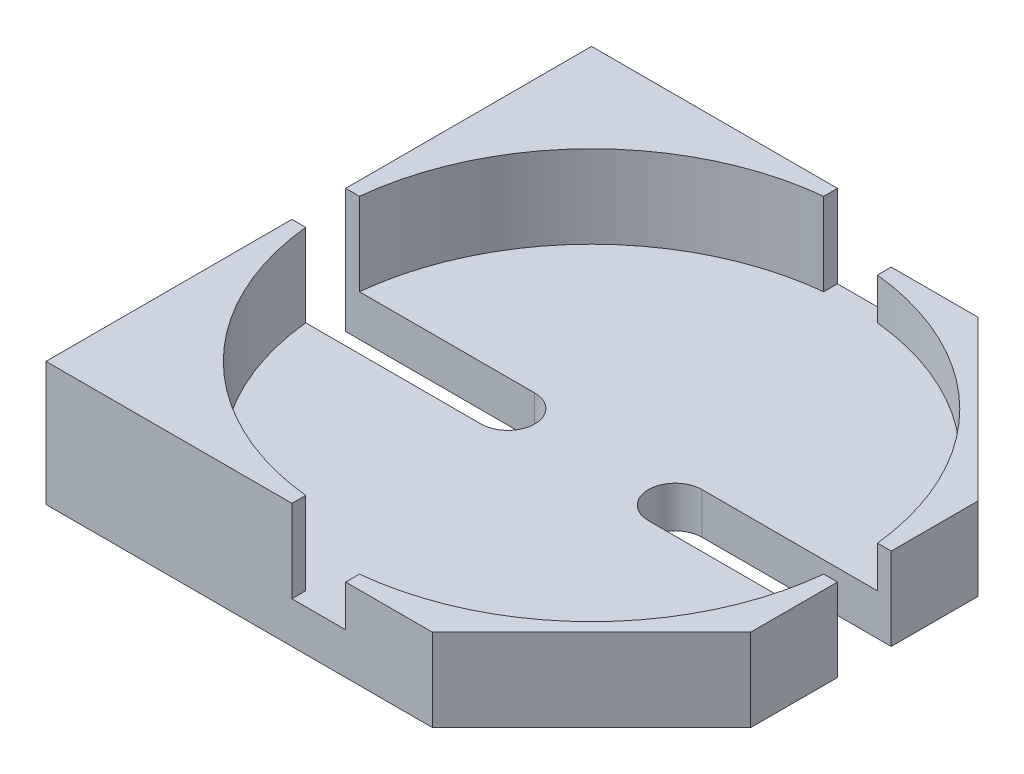
ISO-10303-21;
HEADER;
FILE_DESCRIPTION(('STEP AP214'),'2;1');
FILE_NAME('part.step','',(''),(''),'','','');
FILE_SCHEMA(('AUTOMOTIVE_DESIGN { 1 0 10303 214 1 1 1 1 }'));
ENDSEC;
DATA;
#1=APPLICATION_CONTEXT('core data for automotive mechanical design processes');
#2=APPLICATION_PROTOCOL_DEFINITION('international standard','automotive_design',2000,#1);
#3=PRODUCT_CONTEXT('',#1,'mechanical');
#4=PRODUCT('Part','Part','',(#3));
#5=PRODUCT_RELATED_PRODUCT_CATEGORY('part','',(#4));
#6=PRODUCT_DEFINITION_FORMATION('','',#4);
#7=PRODUCT_DEFINITION_CONTEXT('part definition',#1,'design');
#8=PRODUCT_DEFINITION('design','',#6,#7);
#9=PRODUCT_DEFINITION_SHAPE('','',#8);
#10=(LENGTH_UNIT() NAMED_UNIT(*) SI_UNIT(.MILLI.,.METRE.));
#11=(NAMED_UNIT(*) PLANE_ANGLE_UNIT() SI_UNIT($,.RADIAN.));
#12=(NAMED_UNIT(*) SI_UNIT($,.STERADIAN.) SOLID_ANGLE_UNIT());
#13=UNCERTAINTY_MEASURE_WITH_UNIT(LENGTH_MEASURE(1.E-05),#10,'distance_accuracy_value','');
#14=(GEOMETRIC_REPRESENTATION_CONTEXT(3) GLOBAL_UNCERTAINTY_ASSIGNED_CONTEXT((#13)) GLOBAL_UNIT_ASSIGNED_CONTEXT((#10,
#11,#12)) REPRESENTATION_CONTEXT('',''));
#15=CARTESIAN_POINT('',(0.,0.,0.));
#16=DIRECTION('',(0.,0.,1.));
#17=DIRECTION('',(1.,0.,0.));
#18=AXIS2_PLACEMENT_3D('',#15,#16,#17);
#19=CARTESIAN_POINT('',(0.,1.,0.));
#20=DIRECTION('',(0.,1.,0.));
#21=DIRECTION('',(1.,0.,0.));
#22=AXIS2_PLACEMENT_3D('',#19,#20,#21);
#23=PLANE('',#22);
#24=CARTESIAN_POINT('',(0.,1.,0.));
#25=DIRECTION('',(0.,1.,0.));
#26=DIRECTION('',(0.,0.,1.));
#27=AXIS2_PLACEMENT_3D('',#24,#25,#26);
#28=CIRCLE('',#27,3.15);
#29=CARTESIAN_POINT('',(0.325000000000011,1.,3.13318926973778));
#30=VERTEX_POINT('',#29);
#31=CARTESIAN_POINT('',(3.13318926973778,1.,0.325));
#32=VERTEX_POINT('',#31);
#33=EDGE_CURVE('E26',#30,#32,#28,.T.);
#34=ORIENTED_EDGE('',*,*,#33,.F.);
#35=DIRECTION('',(0.,0.,-1.));
#36=VECTOR('',#35,1.);
#37=CARTESIAN_POINT('',(0.325000000000011,1.,0.));
#38=LINE('',#37,#36);
#39=CARTESIAN_POINT('',(0.325000000000011,1.,3.3));
#40=VERTEX_POINT('',#39);
#41=EDGE_CURVE('E11',#40,#30,#38,.T.);
#42=ORIENTED_EDGE('',*,*,#41,.F.);
#43=DIRECTION('',(1.,0.,0.));
#44=VECTOR('',#43,1.);
#45=CARTESIAN_POINT('',(0.,1.,3.3));
#46=LINE('',#45,#44);
#47=CARTESIAN_POINT('',(1.37500000000002,1.,3.3));
#48=VERTEX_POINT('',#47);
#49=EDGE_CURVE('E383',#40,#48,#46,.T.);
#50=ORIENTED_EDGE('',*,*,#49,.T.);
#51=DIRECTION('',(0.707106781186544,0.,-0.707106781186552));
#52=VECTOR('',#51,1.);
#53=CARTESIAN_POINT('',(2.3375,1.,2.3375));
#54=LINE('',#53,#52);
#55=CARTESIAN_POINT('',(3.3,1.,1.375));
#56=VERTEX_POINT('',#55);
#57=EDGE_CURVE('E370',#48,#56,#54,.T.);
#58=ORIENTED_EDGE('',*,*,#57,.T.);
#59=DIRECTION('',(0.,0.,-1.));
#60=VECTOR('',#59,1.);
#61=CARTESIAN_POINT('',(3.3,1.,0.));
#62=LINE('',#61,#60);
#63=CARTESIAN_POINT('',(3.3,1.,0.325));
#64=VERTEX_POINT('',#63);
#65=EDGE_CURVE('E431',#56,#64,#62,.T.);
#66=ORIENTED_EDGE('',*,*,#65,.T.);
#67=DIRECTION('',(-1.,0.,0.));
#68=VECTOR('',#67,1.);
#69=CARTESIAN_POINT('',(0.,1.,0.325));
#70=LINE('',#69,#68);
#71=EDGE_CURVE('E259',#64,#32,#70,.T.);
#72=ORIENTED_EDGE('',*,*,#71,.T.);
#73=EDGE_LOOP('',(#34,#42,#50,#58,#66,#72));
#74=FACE_BOUND('',#73,.T.);
#75=ADVANCED_FACE('F17',(#74),#23,.T.);
#76=CARTESIAN_POINT('',(0.325000000000011,1.,0.));
#77=DIRECTION('',(-1.,0.,0.));
#78=DIRECTION('',(0.,0.,1.));
#79=AXIS2_PLACEMENT_3D('',#76,#77,#78);
#80=PLANE('',#79);
#81=DIRECTION('',(0.,0.,-1.));
#82=VECTOR('',#81,1.);
#83=CARTESIAN_POINT('',(0.325000000000011,0.5,0.));
#84=LINE('',#83,#82);
#85=CARTESIAN_POINT('',(0.325000000000011,0.5,3.3));
#86=VERTEX_POINT('',#85);
#87=CARTESIAN_POINT('',(0.325000000000011,0.5,3.13318926973778));
#88=VERTEX_POINT('',#87);
#89=EDGE_CURVE('E277',#86,#88,#84,.T.);
#90=ORIENTED_EDGE('',*,*,#89,.F.);
#91=DIRECTION('',(0.,-1.,0.));
#92=VECTOR('',#91,1.);
#93=CARTESIAN_POINT('',(0.325000000000011,1.,3.3));
#94=LINE('',#93,#92);
#95=EDGE_CURVE('E387',#40,#86,#94,.T.);
#96=ORIENTED_EDGE('',*,*,#95,.F.);
#97=ORIENTED_EDGE('',*,*,#41,.T.);
#98=DIRECTION('',(0.,-1.,0.));
#99=VECTOR('',#98,1.);
#100=CARTESIAN_POINT('',(0.325000000000011,1.,3.13318926973778));
#101=LINE('',#100,#99);
#102=EDGE_CURVE('E542',#30,#88,#101,.T.);
#103=ORIENTED_EDGE('',*,*,#102,.T.);
#104=EDGE_LOOP('',(#90,#96,#97,#103));
#105=FACE_BOUND('',#104,.T.);
#106=ADVANCED_FACE('F19',(#105),#80,.T.);
#107=CARTESIAN_POINT('',(0.,1.,0.));
#108=DIRECTION('',(0.,-1.,0.));
#109=DIRECTION('',(0.,0.,-1.));
#110=AXIS2_PLACEMENT_3D('',#107,#108,#109);
#111=CYLINDRICAL_SURFACE('',#110,3.15);
#112=CARTESIAN_POINT('',(0.,0.5,0.));
#113=DIRECTION('',(0.,1.,0.));
#114=DIRECTION('',(0.,0.,1.));
#115=AXIS2_PLACEMENT_3D('',#112,#113,#114);
#116=CIRCLE('',#115,3.15);
#117=CARTESIAN_POINT('',(3.13318926973778,0.5,0.325));
#118=VERTEX_POINT('',#117);
#119=EDGE_CURVE('E255',#88,#118,#116,.T.);
#120=ORIENTED_EDGE('',*,*,#119,.F.);
#121=ORIENTED_EDGE('',*,*,#102,.F.);
#122=ORIENTED_EDGE('',*,*,#33,.T.);
#123=DIRECTION('',(0.,-1.,0.));
#124=VECTOR('',#123,1.);
#125=CARTESIAN_POINT('',(3.13318926973778,1.,0.325));
#126=LINE('',#125,#124);
#127=EDGE_CURVE('E250',#32,#118,#126,.T.);
#128=ORIENTED_EDGE('',*,*,#127,.T.);
#129=EDGE_LOOP('',(#120,#121,#122,#128));
#130=FACE_BOUND('',#129,.T.);
#131=ADVANCED_FACE('F252',(#130),#111,.F.);
#132=CARTESIAN_POINT('',(0.,1.,0.));
#133=DIRECTION('',(0.,1.,0.));
#134=DIRECTION('',(1.,0.,0.));
#135=AXIS2_PLACEMENT_3D('',#132,#133,#134);
#136=PLANE('',#135);
#137=CARTESIAN_POINT('',(0.,1.,0.));
#138=DIRECTION('',(0.,1.,0.));
#139=DIRECTION('',(0.,0.,1.));
#140=AXIS2_PLACEMENT_3D('',#137,#138,#139);
#141=CIRCLE('',#140,3.15);
#142=CARTESIAN_POINT('',(3.13318926973778,1.,-0.325));
#143=VERTEX_POINT('',#142);
#144=CARTESIAN_POINT('',(0.325000000000005,1.,-3.13318926973778));
#145=VERTEX_POINT('',#144);
#146=EDGE_CURVE('E347',#143,#145,#141,.T.);
#147=ORIENTED_EDGE('',*,*,#146,.F.);
#148=DIRECTION('',(1.,0.,0.));
#149=VECTOR('',#148,1.);
#150=CARTESIAN_POINT('',(0.,1.,-0.325));
#151=LINE('',#150,#149);
#152=CARTESIAN_POINT('',(3.3,1.,-0.325));
#153=VERTEX_POINT('',#152);
#154=EDGE_CURVE('E444',#143,#153,#151,.T.);
#155=ORIENTED_EDGE('',*,*,#154,.T.);
#156=DIRECTION('',(0.,0.,-1.));
#157=VECTOR('',#156,1.);
#158=CARTESIAN_POINT('',(3.3,1.,0.));
#159=LINE('',#158,#157);
#160=CARTESIAN_POINT('',(3.3,1.,-1.375));
#161=VERTEX_POINT('',#160);
#162=EDGE_CURVE('E477',#153,#161,#159,.T.);
#163=ORIENTED_EDGE('',*,*,#162,.T.);
#164=DIRECTION('',(-0.707106781186549,0.,-0.707106781186546));
#165=VECTOR('',#164,1.);
#166=CARTESIAN_POINT('',(2.3375,1.,-2.3375));
#167=LINE('',#166,#165);
#168=CARTESIAN_POINT('',(1.375,1.,-3.3));
#169=VERTEX_POINT('',#168);
#170=EDGE_CURVE('E395',#161,#169,#167,.T.);
#171=ORIENTED_EDGE('',*,*,#170,.T.);
#172=DIRECTION('',(-1.,0.,0.));
#173=VECTOR('',#172,1.);
#174=CARTESIAN_POINT('',(0.,1.,-3.3));
#175=LINE('',#174,#173);
#176=CARTESIAN_POINT('',(0.325000000000005,1.,-3.3));
#177=VERTEX_POINT('',#176);
#178=EDGE_CURVE('E402',#169,#177,#175,.T.);
#179=ORIENTED_EDGE('',*,*,#178,.T.);
#180=DIRECTION('',(0.,0.,1.));
#181=VECTOR('',#180,1.);
#182=CARTESIAN_POINT('',(0.325000000000005,1.,0.));
#183=LINE('',#182,#181);
#184=EDGE_CURVE('E48',#177,#145,#183,.T.);
#185=ORIENTED_EDGE('',*,*,#184,.T.);
#186=EDGE_LOOP('',(#147,#155,#163,#171,#179,#185));
#187=FACE_BOUND('',#186,.T.);
#188=ADVANCED_FACE('F1158',(#187),#136,.T.);
#189=CARTESIAN_POINT('',(0.325000000000005,1.,0.));
#190=DIRECTION('',(1.,0.,0.));
#191=DIRECTION('',(0.,1.,0.));
#192=AXIS2_PLACEMENT_3D('',#189,#190,#191);
#193=PLANE('',#192);
#194=DIRECTION('',(0.,0.,1.));
#195=VECTOR('',#194,1.);
#196=CARTESIAN_POINT('',(0.325000000000005,0.5,0.));
#197=LINE('',#196,#195);
#198=CARTESIAN_POINT('',(0.325000000000005,0.5,-3.3));
#199=VERTEX_POINT('',#198);
#200=CARTESIAN_POINT('',(0.325000000000005,0.5,-3.13318926973778));
#201=VERTEX_POINT('',#200);
#202=EDGE_CURVE('E315',#199,#201,#197,.T.);
#203=ORIENTED_EDGE('',*,*,#202,.T.);
#204=DIRECTION('',(0.,-1.,0.));
#205=VECTOR('',#204,1.);
#206=CARTESIAN_POINT('',(0.325000000000005,1.,-3.13318926973778));
#207=LINE('',#206,#205);
#208=EDGE_CURVE('E351',#145,#201,#207,.T.);
#209=ORIENTED_EDGE('',*,*,#208,.F.);
#210=ORIENTED_EDGE('',*,*,#184,.F.);
#211=DIRECTION('',(0.,-1.,0.));
#212=VECTOR('',#211,1.);
#213=CARTESIAN_POINT('',(0.325000000000005,1.,-3.3));
#214=LINE('',#213,#212);
#215=EDGE_CURVE('E399',#177,#199,#214,.T.);
#216=ORIENTED_EDGE('',*,*,#215,.T.);
#217=EDGE_LOOP('',(#203,#209,#210,#216));
#218=FACE_BOUND('',#217,.T.);
#219=ADVANCED_FACE('F1149',(#218),#193,.F.);
#220=CARTESIAN_POINT('',(0.,1.,0.));
#221=DIRECTION('',(0.,-1.,0.));
#222=DIRECTION('',(0.,0.,-1.));
#223=AXIS2_PLACEMENT_3D('',#220,#221,#222);
#224=CYLINDRICAL_SURFACE('',#223,3.15);
#225=CARTESIAN_POINT('',(0.,0.5,0.));
#226=DIRECTION('',(0.,1.,0.));
#227=DIRECTION('',(0.,0.,1.));
#228=AXIS2_PLACEMENT_3D('',#225,#226,#227);
#229=CIRCLE('',#228,3.15);
#230=CARTESIAN_POINT('',(3.13318926973778,0.5,-0.325));
#231=VERTEX_POINT('',#230);
#232=EDGE_CURVE('E292',#231,#201,#229,.T.);
#233=ORIENTED_EDGE('',*,*,#232,.F.);
#234=DIRECTION('',(0.,-1.,0.));
#235=VECTOR('',#234,1.);
#236=CARTESIAN_POINT('',(3.13318926973778,1.,-0.325));
#237=LINE('',#236,#235);
#238=EDGE_CURVE('E437',#143,#231,#237,.T.);
#239=ORIENTED_EDGE('',*,*,#238,.F.);
#240=ORIENTED_EDGE('',*,*,#146,.T.);
#241=ORIENTED_EDGE('',*,*,#208,.T.);
#242=EDGE_LOOP('',(#233,#239,#240,#241));
#243=FACE_BOUND('',#242,.T.);
#244=ADVANCED_FACE('F1132',(#243),#224,.F.);
#245=CARTESIAN_POINT('',(0.,1.5,0.));
#246=DIRECTION('',(0.,1.,0.));
#247=DIRECTION('',(1.,0.,0.));
#248=AXIS2_PLACEMENT_3D('',#245,#246,#247);
#249=PLANE('',#248);
#250=CARTESIAN_POINT('',(0.,1.5,0.));
#251=DIRECTION('',(0.,1.,0.));
#252=DIRECTION('',(0.,0.,1.));
#253=AXIS2_PLACEMENT_3D('',#250,#251,#252);
#254=CIRCLE('',#253,3.15);
#255=CARTESIAN_POINT('',(-3.13318926973778,1.5,0.325));
#256=VERTEX_POINT('',#255);
#257=CARTESIAN_POINT('',(-0.325,1.5,3.13318926973778));
#258=VERTEX_POINT('',#257);
#259=EDGE_CURVE('E532',#256,#258,#254,.T.);
#260=ORIENTED_EDGE('',*,*,#259,.F.);
#261=DIRECTION('',(-1.,0.,0.));
#262=VECTOR('',#261,1.);
#263=CARTESIAN_POINT('',(0.,1.5,0.325));
#264=LINE('',#263,#262);
#265=CARTESIAN_POINT('',(-3.3,1.5,0.325));
#266=VERTEX_POINT('',#265);
#267=EDGE_CURVE('E468',#256,#266,#264,.T.);
#268=ORIENTED_EDGE('',*,*,#267,.T.);
#269=DIRECTION('',(0.,0.,1.));
#270=VECTOR('',#269,1.);
#271=CARTESIAN_POINT('',(-3.3,1.5,0.));
#272=LINE('',#271,#270);
#273=CARTESIAN_POINT('',(-3.3,1.5,3.3));
#274=VERTEX_POINT('',#273);
#275=EDGE_CURVE('E356',#266,#274,#272,.T.);
#276=ORIENTED_EDGE('',*,*,#275,.T.);
#277=DIRECTION('',(1.,0.,0.));
#278=VECTOR('',#277,1.);
#279=CARTESIAN_POINT('',(0.,1.5,3.3));
#280=LINE('',#279,#278);
#281=CARTESIAN_POINT('',(-0.325,1.5,3.3));
#282=VERTEX_POINT('',#281);
#283=EDGE_CURVE('E398',#274,#282,#280,.T.);
#284=ORIENTED_EDGE('',*,*,#283,.T.);
#285=DIRECTION('',(0.,0.,-1.));
#286=VECTOR('',#285,1.);
#287=CARTESIAN_POINT('',(-0.325,1.5,0.));
#288=LINE('',#287,#286);
#289=EDGE_CURVE('E352',#282,#258,#288,.T.);
#290=ORIENTED_EDGE('',*,*,#289,.T.);
#291=EDGE_LOOP('',(#260,#268,#276,#284,#290));
#292=FACE_BOUND('',#291,.T.);
#293=ADVANCED_FACE('F1123',(#292),#249,.T.);
#294=CARTESIAN_POINT('',(-0.325,1.5,0.));
#295=DIRECTION('',(-1.,0.,0.));
#296=DIRECTION('',(0.,0.,1.));
#297=AXIS2_PLACEMENT_3D('',#294,#295,#296);
#298=PLANE('',#297);
#299=DIRECTION('',(0.,0.,-1.));
#300=VECTOR('',#299,1.);
#301=CARTESIAN_POINT('',(-0.325,0.5,0.));
#302=LINE('',#301,#300);
#303=CARTESIAN_POINT('',(-0.325,0.5,3.3));
#304=VERTEX_POINT('',#303);
#305=CARTESIAN_POINT('',(-0.325,0.5,3.13318926973778));
#306=VERTEX_POINT('',#305);
#307=EDGE_CURVE('E303',#304,#306,#302,.T.);
#308=ORIENTED_EDGE('',*,*,#307,.T.);
#309=DIRECTION('',(0.,-1.,0.));
#310=VECTOR('',#309,1.);
#311=CARTESIAN_POINT('',(-0.325,1.5,3.13318926973778));
#312=LINE('',#311,#310);
#313=EDGE_CURVE('E501',#258,#306,#312,.T.);
#314=ORIENTED_EDGE('',*,*,#313,.F.);
#315=ORIENTED_EDGE('',*,*,#289,.F.);
#316=DIRECTION('',(0.,-1.,0.));
#317=VECTOR('',#316,1.);
#318=CARTESIAN_POINT('',(-0.325,1.5,3.3));
#319=LINE('',#318,#317);
#320=EDGE_CURVE('E390',#282,#304,#319,.T.);
#321=ORIENTED_EDGE('',*,*,#320,.T.);
#322=EDGE_LOOP('',(#308,#314,#315,#321));
#323=FACE_BOUND('',#322,.T.);
#324=ADVANCED_FACE('F1114',(#323),#298,.F.);
#325=CARTESIAN_POINT('',(0.,1.5,0.));
#326=DIRECTION('',(0.,-1.,0.));
#327=DIRECTION('',(0.,0.,-1.));
#328=AXIS2_PLACEMENT_3D('',#325,#326,#327);
#329=CYLINDRICAL_SURFACE('',#328,3.15);
#330=CARTESIAN_POINT('',(0.,0.5,0.));
#331=DIRECTION('',(0.,1.,0.));
#332=DIRECTION('',(0.,0.,1.));
#333=AXIS2_PLACEMENT_3D('',#330,#331,#332);
#334=CIRCLE('',#333,3.15);
#335=CARTESIAN_POINT('',(-3.13318926973778,0.5,0.325));
#336=VERTEX_POINT('',#335);
#337=EDGE_CURVE('E299',#336,#306,#334,.T.);
#338=ORIENTED_EDGE('',*,*,#337,.F.);
#339=DIRECTION('',(0.,-1.,0.));
#340=VECTOR('',#339,1.);
#341=CARTESIAN_POINT('',(-3.13318926973778,1.5,0.325));
#342=LINE('',#341,#340);
#343=EDGE_CURVE('E311',#256,#336,#342,.T.);
#344=ORIENTED_EDGE('',*,*,#343,.F.);
#345=ORIENTED_EDGE('',*,*,#259,.T.);
#346=ORIENTED_EDGE('',*,*,#313,.T.);
#347=EDGE_LOOP('',(#338,#344,#345,#346));
#348=FACE_BOUND('',#347,.T.);
#349=ADVANCED_FACE('F1105',(#348),#329,.F.);
#350=CARTESIAN_POINT('',(0.,1.5,0.));
#351=DIRECTION('',(0.,1.,0.));
#352=DIRECTION('',(1.,0.,0.));
#353=AXIS2_PLACEMENT_3D('',#350,#351,#352);
#354=PLANE('',#353);
#355=CARTESIAN_POINT('',(0.,1.5,0.));
#356=DIRECTION('',(0.,1.,0.));
#357=DIRECTION('',(0.,0.,1.));
#358=AXIS2_PLACEMENT_3D('',#355,#356,#357);
#359=CIRCLE('',#358,3.15);
#360=CARTESIAN_POINT('',(-0.325000000000007,1.5,-3.13318926973778));
#361=VERTEX_POINT('',#360);
#362=CARTESIAN_POINT('',(-3.13318926973778,1.5,-0.325));
#363=VERTEX_POINT('',#362);
#364=EDGE_CURVE('E310',#361,#363,#359,.T.);
#365=ORIENTED_EDGE('',*,*,#364,.F.);
#366=DIRECTION('',(0.,0.,1.));
#367=VECTOR('',#366,1.);
#368=CARTESIAN_POINT('',(-0.325000000000009,1.5,0.));
#369=LINE('',#368,#367);
#370=CARTESIAN_POINT('',(-0.325000000000007,1.5,-3.3));
#371=VERTEX_POINT('',#370);
#372=EDGE_CURVE('E529',#371,#361,#369,.T.);
#373=ORIENTED_EDGE('',*,*,#372,.F.);
#374=DIRECTION('',(-1.,0.,0.));
#375=VECTOR('',#374,1.);
#376=CARTESIAN_POINT('',(0.,1.5,-3.3));
#377=LINE('',#376,#375);
#378=CARTESIAN_POINT('',(-3.3,1.5,-3.3));
#379=VERTEX_POINT('',#378);
#380=EDGE_CURVE('E495',#371,#379,#377,.T.);
#381=ORIENTED_EDGE('',*,*,#380,.T.);
#382=DIRECTION('',(0.,0.,1.));
#383=VECTOR('',#382,1.);
#384=CARTESIAN_POINT('',(-3.3,1.5,0.));
#385=LINE('',#384,#383);
#386=CARTESIAN_POINT('',(-3.3,1.5,-0.325));
#387=VERTEX_POINT('',#386);
#388=EDGE_CURVE('E426',#379,#387,#385,.T.);
#389=ORIENTED_EDGE('',*,*,#388,.T.);
#390=DIRECTION('',(1.,0.,0.));
#391=VECTOR('',#390,1.);
#392=CARTESIAN_POINT('',(0.,1.5,-0.325));
#393=LINE('',#392,#391);
#394=EDGE_CURVE('E360',#387,#363,#393,.T.);
#395=ORIENTED_EDGE('',*,*,#394,.T.);
#396=EDGE_LOOP('',(#365,#373,#381,#389,#395));
#397=FACE_BOUND('',#396,.T.);
#398=ADVANCED_FACE('F1096',(#397),#354,.T.);
#399=CARTESIAN_POINT('',(-0.325000000000009,1.5,0.));
#400=DIRECTION('',(1.,0.,0.));
#401=DIRECTION('',(0.,0.,1.));
#402=AXIS2_PLACEMENT_3D('',#399,#400,#401);
#403=PLANE('',#402);
#404=DIRECTION('',(0.,0.,1.));
#405=VECTOR('',#404,1.);
#406=CARTESIAN_POINT('',(-0.325000000000009,0.5,0.));
#407=LINE('',#406,#405);
#408=CARTESIAN_POINT('',(-0.325000000000007,0.5,-3.3));
#409=VERTEX_POINT('',#408);
#410=CARTESIAN_POINT('',(-0.325000000000007,0.5,-3.13318926973778));
#411=VERTEX_POINT('',#410);
#412=EDGE_CURVE('E327',#409,#411,#407,.T.);
#413=ORIENTED_EDGE('',*,*,#412,.F.);
#414=DIRECTION('',(0.,-1.,0.));
#415=VECTOR('',#414,1.);
#416=CARTESIAN_POINT('',(-0.325000000000007,1.5,-3.3));
#417=LINE('',#416,#415);
#418=EDGE_CURVE('E403',#371,#409,#417,.T.);
#419=ORIENTED_EDGE('',*,*,#418,.F.);
#420=ORIENTED_EDGE('',*,*,#372,.T.);
#421=DIRECTION('',(0.,-1.,0.));
#422=VECTOR('',#421,1.);
#423=CARTESIAN_POINT('',(-0.325000000000007,1.5,-3.13318926973778));
#424=LINE('',#423,#422);
#425=EDGE_CURVE('E307',#361,#411,#424,.T.);
#426=ORIENTED_EDGE('',*,*,#425,.T.);
#427=EDGE_LOOP('',(#413,#419,#420,#426));
#428=FACE_BOUND('',#427,.T.);
#429=ADVANCED_FACE('F1087',(#428),#403,.T.);
#430=CARTESIAN_POINT('',(0.,1.5,0.));
#431=DIRECTION('',(0.,-1.,0.));
#432=DIRECTION('',(0.,0.,-1.));
#433=AXIS2_PLACEMENT_3D('',#430,#431,#432);
#434=CYLINDRICAL_SURFACE('',#433,3.15);
#435=CARTESIAN_POINT('',(0.,0.5,0.));
#436=DIRECTION('',(0.,1.,0.));
#437=DIRECTION('',(0.,0.,1.));
#438=AXIS2_PLACEMENT_3D('',#435,#436,#437);
#439=CIRCLE('',#438,3.15);
#440=CARTESIAN_POINT('',(-3.13318926973778,0.5,-0.325));
#441=VERTEX_POINT('',#440);
#442=EDGE_CURVE('E334',#411,#441,#439,.T.);
#443=ORIENTED_EDGE('',*,*,#442,.F.);
#444=ORIENTED_EDGE('',*,*,#425,.F.);
#445=ORIENTED_EDGE('',*,*,#364,.T.);
#446=DIRECTION('',(0.,-1.,0.));
#447=VECTOR('',#446,1.);
#448=CARTESIAN_POINT('',(-3.13318926973778,1.5,-0.325));
#449=LINE('',#448,#447);
#450=EDGE_CURVE('E357',#363,#441,#449,.T.);
#451=ORIENTED_EDGE('',*,*,#450,.T.);
#452=EDGE_LOOP('',(#443,#444,#445,#451));
#453=FACE_BOUND('',#452,.T.);
#454=ADVANCED_FACE('F1078',(#453),#434,.F.);
#455=CARTESIAN_POINT('',(1.0125,0.,0.));
#456=DIRECTION('',(0.,1.,0.));
#457=DIRECTION('',(1.,0.,0.));
#458=AXIS2_PLACEMENT_3D('',#455,#456,#457);
#459=PLANE('',#458);
#460=DIRECTION('',(0.,0.,1.));
#461=VECTOR('',#460,1.);
#462=CARTESIAN_POINT('',(-3.3,0.,0.325));
#463=LINE('',#462,#461);
#464=CARTESIAN_POINT('',(-3.3,0.,0.325));
#465=VERTEX_POINT('',#464);
#466=CARTESIAN_POINT('',(-3.3,0.,3.3));
#467=VERTEX_POINT('',#466);
#468=EDGE_CURVE('E318',#465,#467,#463,.T.);
#469=ORIENTED_EDGE('',*,*,#468,.F.);
#470=DIRECTION('',(-1.,0.,0.));
#471=VECTOR('',#470,1.);
#472=CARTESIAN_POINT('',(-1.0125,0.,0.325));
#473=LINE('',#472,#471);
#474=CARTESIAN_POINT('',(-1.0125,0.,0.325));
#475=VERTEX_POINT('',#474);
#476=EDGE_CURVE('E471',#475,#465,#473,.T.);
#477=ORIENTED_EDGE('',*,*,#476,.F.);
#478=CARTESIAN_POINT('',(-1.0125,0.,0.));
#479=DIRECTION('',(0.,-1.,0.));
#480=DIRECTION('',(0.,0.,1.));
#481=AXIS2_PLACEMENT_3D('',#478,#479,#480);
#482=CIRCLE('',#481,0.325);
#483=CARTESIAN_POINT('',(-1.0125,0.,-0.325));
#484=VERTEX_POINT('',#483);
#485=EDGE_CURVE('E515',#484,#475,#482,.T.);
#486=ORIENTED_EDGE('',*,*,#485,.F.);
#487=DIRECTION('',(1.,0.,0.));
#488=VECTOR('',#487,1.);
#489=CARTESIAN_POINT('',(-1.0125,0.,-0.325));
#490=LINE('',#489,#488);
#491=CARTESIAN_POINT('',(-3.3,0.,-0.325));
#492=VERTEX_POINT('',#491);
#493=EDGE_CURVE('E481',#492,#484,#490,.T.);
#494=ORIENTED_EDGE('',*,*,#493,.F.);
#495=DIRECTION('',(0.,0.,1.));
#496=VECTOR('',#495,1.);
#497=CARTESIAN_POINT('',(-3.3,0.,-3.3));
#498=LINE('',#497,#496);
#499=CARTESIAN_POINT('',(-3.3,0.,-3.3));
#500=VERTEX_POINT('',#499);
#501=EDGE_CURVE('E427',#500,#492,#498,.T.);
#502=ORIENTED_EDGE('',*,*,#501,.F.);
#503=DIRECTION('',(-1.,0.,0.));
#504=VECTOR('',#503,1.);
#505=CARTESIAN_POINT('',(1.375,0.,-3.3));
#506=LINE('',#505,#504);
#507=CARTESIAN_POINT('',(1.375,0.,-3.3));
#508=VERTEX_POINT('',#507);
#509=EDGE_CURVE('E410',#508,#500,#506,.T.);
#510=ORIENTED_EDGE('',*,*,#509,.F.);
#511=DIRECTION('',(-0.707106781186549,0.,-0.707106781186546));
#512=VECTOR('',#511,1.);
#513=CARTESIAN_POINT('',(1.375,0.,-3.3));
#514=LINE('',#513,#512);
#515=CARTESIAN_POINT('',(3.3,0.,-1.375));
#516=VERTEX_POINT('',#515);
#517=EDGE_CURVE('E284',#516,#508,#514,.T.);
#518=ORIENTED_EDGE('',*,*,#517,.F.);
#519=DIRECTION('',(0.,0.,-1.));
#520=VECTOR('',#519,1.);
#521=CARTESIAN_POINT('',(3.3,0.,-1.375));
#522=LINE('',#521,#520);
#523=CARTESIAN_POINT('',(3.3,0.,-0.325));
#524=VERTEX_POINT('',#523);
#525=EDGE_CURVE('E432',#524,#516,#522,.T.);
#526=ORIENTED_EDGE('',*,*,#525,.F.);
#527=DIRECTION('',(1.,0.,0.));
#528=VECTOR('',#527,1.);
#529=CARTESIAN_POINT('',(1.0125,0.,-0.325));
#530=LINE('',#529,#528);
#531=CARTESIAN_POINT('',(1.0125,0.,-0.325));
#532=VERTEX_POINT('',#531);
#533=EDGE_CURVE('E461',#532,#524,#530,.T.);
#534=ORIENTED_EDGE('',*,*,#533,.F.);
#535=CARTESIAN_POINT('',(1.0125,0.,0.));
#536=DIRECTION('',(0.,-1.,0.));
#537=DIRECTION('',(0.,0.,1.));
#538=AXIS2_PLACEMENT_3D('',#535,#536,#537);
#539=CIRCLE('',#538,0.325);
#540=CARTESIAN_POINT('',(1.0125,0.,0.325));
#541=VERTEX_POINT('',#540);
#542=EDGE_CURVE('E453',#541,#532,#539,.T.);
#543=ORIENTED_EDGE('',*,*,#542,.F.);
#544=DIRECTION('',(-1.,0.,0.));
#545=VECTOR('',#544,1.);
#546=CARTESIAN_POINT('',(1.0125,0.,0.325));
#547=LINE('',#546,#545);
#548=CARTESIAN_POINT('',(3.3,0.,0.325));
#549=VERTEX_POINT('',#548);
#550=EDGE_CURVE('E441',#549,#541,#547,.T.);
#551=ORIENTED_EDGE('',*,*,#550,.F.);
#552=DIRECTION('',(0.,0.,-1.));
#553=VECTOR('',#552,1.);
#554=CARTESIAN_POINT('',(3.3,0.,0.325));
#555=LINE('',#554,#553);
#556=CARTESIAN_POINT('',(3.3,0.,1.375));
#557=VERTEX_POINT('',#556);
#558=EDGE_CURVE('E417',#557,#549,#555,.T.);
#559=ORIENTED_EDGE('',*,*,#558,.F.);
#560=DIRECTION('',(0.707106781186544,0.,-0.707106781186552));
#561=VECTOR('',#560,1.);
#562=CARTESIAN_POINT('',(1.37500000000002,0.,3.3));
#563=LINE('',#562,#561);
#564=CARTESIAN_POINT('',(1.37500000000002,0.,3.3));
#565=VERTEX_POINT('',#564);
#566=EDGE_CURVE('E371',#565,#557,#563,.T.);
#567=ORIENTED_EDGE('',*,*,#566,.F.);
#568=DIRECTION('',(1.,0.,0.));
#569=VECTOR('',#568,1.);
#570=CARTESIAN_POINT('',(1.37500000000002,0.,3.3));
#571=LINE('',#570,#569);
#572=EDGE_CURVE('E375',#467,#565,#571,.T.);
#573=ORIENTED_EDGE('',*,*,#572,.F.);
#574=EDGE_LOOP('',(#469,#477,#486,#494,#502,#510,#518,#526,#534,#543,#551,#559,#567,#573));
#575=FACE_BOUND('',#574,.T.);
#576=ADVANCED_FACE('F1069',(#575),#459,.F.);
#577=CARTESIAN_POINT('',(-1.0125,0.5,0.325));
#578=DIRECTION('',(0.,0.,1.));
#579=DIRECTION('',(1.,0.,0.));
#580=AXIS2_PLACEMENT_3D('',#577,#578,#579);
#581=PLANE('',#580);
#582=ORIENTED_EDGE('',*,*,#476,.T.);
#583=DIRECTION('',(0.,-1.,0.));
#584=VECTOR('',#583,1.);
#585=CARTESIAN_POINT('',(-3.3,0.5,0.325));
#586=LINE('',#585,#584);
#587=EDGE_CURVE('E365',#266,#465,#586,.T.);
#588=ORIENTED_EDGE('',*,*,#587,.F.);
#589=ORIENTED_EDGE('',*,*,#267,.F.);
#590=ORIENTED_EDGE('',*,*,#343,.T.);
#591=DIRECTION('',(-1.,0.,0.));
#592=VECTOR('',#591,1.);
#593=CARTESIAN_POINT('',(-1.0125,0.5,0.325));
#594=LINE('',#593,#592);
#595=CARTESIAN_POINT('',(-1.0125,0.5,0.325));
#596=VERTEX_POINT('',#595);
#597=EDGE_CURVE('E297',#596,#336,#594,.T.);
#598=ORIENTED_EDGE('',*,*,#597,.F.);
#599=DIRECTION('',(0.,-1.,0.));
#600=VECTOR('',#599,1.);
#601=CARTESIAN_POINT('',(-1.0125,0.5,0.325));
#602=LINE('',#601,#600);
#603=EDGE_CURVE('E519',#596,#475,#602,.T.);
#604=ORIENTED_EDGE('',*,*,#603,.T.);
#605=EDGE_LOOP('',(#582,#588,#589,#590,#598,#604));
#606=FACE_BOUND('',#605,.T.);
#607=ADVANCED_FACE('F1027',(#606),#581,.F.);
#608=CARTESIAN_POINT('',(-1.0125,0.5,0.));
#609=DIRECTION('',(0.,-1.,0.));
#610=DIRECTION('',(0.,0.,-1.));
#611=AXIS2_PLACEMENT_3D('',#608,#609,#610);
#612=CYLINDRICAL_SURFACE('',#611,0.325);
#613=ORIENTED_EDGE('',*,*,#485,.T.);
#614=ORIENTED_EDGE('',*,*,#603,.F.);
#615=CARTESIAN_POINT('',(-1.0125,0.5,0.));
#616=DIRECTION('',(0.,-1.,0.));
#617=DIRECTION('',(0.,0.,1.));
#618=AXIS2_PLACEMENT_3D('',#615,#616,#617);
#619=CIRCLE('',#618,0.325);
#620=CARTESIAN_POINT('',(-1.0125,0.5,-0.325));
#621=VERTEX_POINT('',#620);
#622=EDGE_CURVE('E293',#621,#596,#619,.T.);
#623=ORIENTED_EDGE('',*,*,#622,.F.);
#624=DIRECTION('',(0.,-1.,0.));
#625=VECTOR('',#624,1.);
#626=CARTESIAN_POINT('',(-1.0125,0.5,-0.325));
#627=LINE('',#626,#625);
#628=EDGE_CURVE('E361',#621,#484,#627,.T.);
#629=ORIENTED_EDGE('',*,*,#628,.T.);
#630=EDGE_LOOP('',(#613,#614,#623,#629));
#631=FACE_BOUND('',#630,.T.);
#632=ADVANCED_FACE('F966',(#631),#612,.F.);
#633=CARTESIAN_POINT('',(-1.0125,0.5,-0.325));
#634=DIRECTION('',(0.,0.,-1.));
#635=DIRECTION('',(-1.,0.,0.));
#636=AXIS2_PLACEMENT_3D('',#633,#634,#635);
#637=PLANE('',#636);
#638=ORIENTED_EDGE('',*,*,#493,.T.);
#639=ORIENTED_EDGE('',*,*,#628,.F.);
#640=DIRECTION('',(1.,0.,0.));
#641=VECTOR('',#640,1.);
#642=CARTESIAN_POINT('',(-1.0125,0.5,-0.325));
#643=LINE('',#642,#641);
#644=EDGE_CURVE('E298',#441,#621,#643,.T.);
#645=ORIENTED_EDGE('',*,*,#644,.F.);
#646=ORIENTED_EDGE('',*,*,#450,.F.);
#647=ORIENTED_EDGE('',*,*,#394,.F.);
#648=DIRECTION('',(0.,-1.,0.));
#649=VECTOR('',#648,1.);
#650=CARTESIAN_POINT('',(-3.3,0.5,-0.325));
#651=LINE('',#650,#649);
#652=EDGE_CURVE('E422',#387,#492,#651,.T.);
#653=ORIENTED_EDGE('',*,*,#652,.T.);
#654=EDGE_LOOP('',(#638,#639,#645,#646,#647,#653));
#655=FACE_BOUND('',#654,.T.);
#656=ADVANCED_FACE('F961',(#655),#637,.F.);
#657=CARTESIAN_POINT('',(-3.3,0.5,-3.3));
#658=DIRECTION('',(1.,0.,0.));
#659=DIRECTION('',(0.,1.,0.));
#660=AXIS2_PLACEMENT_3D('',#657,#658,#659);
#661=PLANE('',#660);
#662=ORIENTED_EDGE('',*,*,#501,.T.);
#663=ORIENTED_EDGE('',*,*,#652,.F.);
#664=ORIENTED_EDGE('',*,*,#388,.F.);
#665=DIRECTION('',(0.,-1.,0.));
#666=VECTOR('',#665,1.);
#667=CARTESIAN_POINT('',(-3.3,0.5,-3.3));
#668=LINE('',#667,#666);
#669=EDGE_CURVE('E488',#379,#500,#668,.T.);
#670=ORIENTED_EDGE('',*,*,#669,.T.);
#671=EDGE_LOOP('',(#662,#663,#664,#670));
#672=FACE_BOUND('',#671,.T.);
#673=ADVANCED_FACE('F965',(#672),#661,.F.);
#674=CARTESIAN_POINT('',(1.375,0.5,-3.3));
#675=DIRECTION('',(0.,0.,1.));
#676=DIRECTION('',(1.,0.,0.));
#677=AXIS2_PLACEMENT_3D('',#674,#675,#676);
#678=PLANE('',#677);
#679=ORIENTED_EDGE('',*,*,#509,.T.);
#680=ORIENTED_EDGE('',*,*,#669,.F.);
#681=ORIENTED_EDGE('',*,*,#380,.F.);
#682=ORIENTED_EDGE('',*,*,#418,.T.);
#683=DIRECTION('',(-1.,0.,0.));
#684=VECTOR('',#683,1.);
#685=CARTESIAN_POINT('',(1.375,0.5,-3.3));
#686=LINE('',#685,#684);
#687=EDGE_CURVE('E323',#199,#409,#686,.T.);
#688=ORIENTED_EDGE('',*,*,#687,.F.);
#689=ORIENTED_EDGE('',*,*,#215,.F.);
#690=ORIENTED_EDGE('',*,*,#178,.F.);
#691=DIRECTION('',(0.,-1.,0.));
#692=VECTOR('',#691,1.);
#693=CARTESIAN_POINT('',(1.375,0.5,-3.3));
#694=LINE('',#693,#692);
#695=EDGE_CURVE('E391',#169,#508,#694,.T.);
#696=ORIENTED_EDGE('',*,*,#695,.T.);
#697=EDGE_LOOP('',(#679,#680,#681,#682,#688,#689,#690,#696));
#698=FACE_BOUND('',#697,.T.);
#699=ADVANCED_FACE('F975',(#698),#678,.F.);
#700=CARTESIAN_POINT('',(1.375,0.5,-3.3));
#701=DIRECTION('',(-0.707106781186546,0.,0.707106781186549));
#702=DIRECTION('',(0.,1.,0.));
#703=AXIS2_PLACEMENT_3D('',#700,#701,#702);
#704=PLANE('',#703);
#705=ORIENTED_EDGE('',*,*,#517,.T.);
#706=ORIENTED_EDGE('',*,*,#695,.F.);
#707=ORIENTED_EDGE('',*,*,#170,.F.);
#708=DIRECTION('',(0.,-1.,0.));
#709=VECTOR('',#708,1.);
#710=CARTESIAN_POINT('',(3.3,0.5,-1.375));
#711=LINE('',#710,#709);
#712=EDGE_CURVE('E436',#161,#516,#711,.T.);
#713=ORIENTED_EDGE('',*,*,#712,.T.);
#714=EDGE_LOOP('',(#705,#706,#707,#713));
#715=FACE_BOUND('',#714,.T.);
#716=ADVANCED_FACE('F1006',(#715),#704,.F.);
#717=CARTESIAN_POINT('',(3.3,0.5,-1.375));
#718=DIRECTION('',(-1.,0.,0.));
#719=DIRECTION('',(0.,0.,1.));
#720=AXIS2_PLACEMENT_3D('',#717,#718,#719);
#721=PLANE('',#720);
#722=ORIENTED_EDGE('',*,*,#525,.T.);
#723=ORIENTED_EDGE('',*,*,#712,.F.);
#724=ORIENTED_EDGE('',*,*,#162,.F.);
#725=DIRECTION('',(0.,-1.,0.));
#726=VECTOR('',#725,1.);
#727=CARTESIAN_POINT('',(3.3,0.5,-0.325));
#728=LINE('',#727,#726);
#729=EDGE_CURVE('E448',#153,#524,#728,.T.);
#730=ORIENTED_EDGE('',*,*,#729,.T.);
#731=EDGE_LOOP('',(#722,#723,#724,#730));
#732=FACE_BOUND('',#731,.T.);
#733=ADVANCED_FACE('F1010',(#732),#721,.F.);
#734=CARTESIAN_POINT('',(1.0125,0.5,-0.325));
#735=DIRECTION('',(0.,0.,-1.));
#736=DIRECTION('',(0.,-1.,0.));
#737=AXIS2_PLACEMENT_3D('',#734,#735,#736);
#738=PLANE('',#737);
#739=ORIENTED_EDGE('',*,*,#533,.T.);
#740=ORIENTED_EDGE('',*,*,#729,.F.);
#741=ORIENTED_EDGE('',*,*,#154,.F.);
#742=ORIENTED_EDGE('',*,*,#238,.T.);
#743=DIRECTION('',(1.,0.,0.));
#744=VECTOR('',#743,1.);
#745=CARTESIAN_POINT('',(1.0125,0.5,-0.325));
#746=LINE('',#745,#744);
#747=CARTESIAN_POINT('',(1.0125,0.5,-0.325));
#748=VERTEX_POINT('',#747);
#749=EDGE_CURVE('E288',#748,#231,#746,.T.);
#750=ORIENTED_EDGE('',*,*,#749,.F.);
#751=DIRECTION('',(0.,-1.,0.));
#752=VECTOR('',#751,1.);
#753=CARTESIAN_POINT('',(1.0125,0.5,-0.325));
#754=LINE('',#753,#752);
#755=EDGE_CURVE('E457',#748,#532,#754,.T.);
#756=ORIENTED_EDGE('',*,*,#755,.T.);
#757=EDGE_LOOP('',(#739,#740,#741,#742,#750,#756));
#758=FACE_BOUND('',#757,.T.);
#759=ADVANCED_FACE('F1036',(#758),#738,.F.);
#760=CARTESIAN_POINT('',(1.0125,0.5,0.));
#761=DIRECTION('',(0.,-1.,0.));
#762=DIRECTION('',(0.,0.,-1.));
#763=AXIS2_PLACEMENT_3D('',#760,#761,#762);
#764=CYLINDRICAL_SURFACE('',#763,0.325);
#765=ORIENTED_EDGE('',*,*,#542,.T.);
#766=ORIENTED_EDGE('',*,*,#755,.F.);
#767=CARTESIAN_POINT('',(1.0125,0.5,0.));
#768=DIRECTION('',(0.,-1.,0.));
#769=DIRECTION('',(0.,0.,1.));
#770=AXIS2_PLACEMENT_3D('',#767,#768,#769);
#771=CIRCLE('',#770,0.325);
#772=CARTESIAN_POINT('',(1.0125,0.5,0.325));
#773=VERTEX_POINT('',#772);
#774=EDGE_CURVE('E271',#773,#748,#771,.T.);
#775=ORIENTED_EDGE('',*,*,#774,.F.);
#776=DIRECTION('',(0.,-1.,0.));
#777=VECTOR('',#776,1.);
#778=CARTESIAN_POINT('',(1.0125,0.5,0.325));
#779=LINE('',#778,#777);
#780=EDGE_CURVE('E260',#773,#541,#779,.T.);
#781=ORIENTED_EDGE('',*,*,#780,.T.);
#782=EDGE_LOOP('',(#765,#766,#775,#781));
#783=FACE_BOUND('',#782,.T.);
#784=ADVANCED_FACE('F1019',(#783),#764,.F.);
#785=CARTESIAN_POINT('',(1.0125,0.5,0.325));
#786=DIRECTION('',(0.,0.,1.));
#787=DIRECTION('',(1.,0.,0.));
#788=AXIS2_PLACEMENT_3D('',#785,#786,#787);
#789=PLANE('',#788);
#790=ORIENTED_EDGE('',*,*,#550,.T.);
#791=ORIENTED_EDGE('',*,*,#780,.F.);
#792=DIRECTION('',(-1.,0.,0.));
#793=VECTOR('',#792,1.);
#794=CARTESIAN_POINT('',(1.0125,0.5,0.325));
#795=LINE('',#794,#793);
#796=EDGE_CURVE('E263',#118,#773,#795,.T.);
#797=ORIENTED_EDGE('',*,*,#796,.F.);
#798=ORIENTED_EDGE('',*,*,#127,.F.);
#799=ORIENTED_EDGE('',*,*,#71,.F.);
#800=DIRECTION('',(0.,-1.,0.));
#801=VECTOR('',#800,1.);
#802=CARTESIAN_POINT('',(3.3,0.5,0.325));
#803=LINE('',#802,#801);
#804=EDGE_CURVE('E421',#64,#549,#803,.T.);
#805=ORIENTED_EDGE('',*,*,#804,.T.);
#806=EDGE_LOOP('',(#790,#791,#797,#798,#799,#805));
#807=FACE_BOUND('',#806,.T.);
#808=ADVANCED_FACE('F265',(#807),#789,.F.);
#809=CARTESIAN_POINT('',(3.3,0.5,0.325));
#810=DIRECTION('',(-1.,0.,0.));
#811=DIRECTION('',(0.,0.,1.));
#812=AXIS2_PLACEMENT_3D('',#809,#810,#811);
#813=PLANE('',#812);
#814=ORIENTED_EDGE('',*,*,#558,.T.);
#815=ORIENTED_EDGE('',*,*,#804,.F.);
#816=ORIENTED_EDGE('',*,*,#65,.F.);
#817=DIRECTION('',(0.,-1.,0.));
#818=VECTOR('',#817,1.);
#819=CARTESIAN_POINT('',(3.3,0.5,1.375));
#820=LINE('',#819,#818);
#821=EDGE_CURVE('E366',#56,#557,#820,.T.);
#822=ORIENTED_EDGE('',*,*,#821,.T.);
#823=EDGE_LOOP('',(#814,#815,#816,#822));
#824=FACE_BOUND('',#823,.T.);
#825=ADVANCED_FACE('F992',(#824),#813,.F.);
#826=CARTESIAN_POINT('',(1.37500000000002,0.5,3.3));
#827=DIRECTION('',(-0.707106781186552,0.,-0.707106781186544));
#828=DIRECTION('',(-0.707106781186544,0.,0.707106781186552));
#829=AXIS2_PLACEMENT_3D('',#826,#827,#828);
#830=PLANE('',#829);
#831=ORIENTED_EDGE('',*,*,#566,.T.);
#832=ORIENTED_EDGE('',*,*,#821,.F.);
#833=ORIENTED_EDGE('',*,*,#57,.F.);
#834=DIRECTION('',(0.,-1.,0.));
#835=VECTOR('',#834,1.);
#836=CARTESIAN_POINT('',(1.37500000000002,0.5,3.3));
#837=LINE('',#836,#835);
#838=EDGE_CURVE('E379',#48,#565,#837,.T.);
#839=ORIENTED_EDGE('',*,*,#838,.T.);
#840=EDGE_LOOP('',(#831,#832,#833,#839));
#841=FACE_BOUND('',#840,.T.);
#842=ADVANCED_FACE('F949',(#841),#830,.F.);
#843=CARTESIAN_POINT('',(1.37500000000002,0.5,3.3));
#844=DIRECTION('',(0.,0.,-1.));
#845=DIRECTION('',(0.,-1.,0.));
#846=AXIS2_PLACEMENT_3D('',#843,#844,#845);
#847=PLANE('',#846);
#848=ORIENTED_EDGE('',*,*,#572,.T.);
#849=ORIENTED_EDGE('',*,*,#838,.F.);
#850=ORIENTED_EDGE('',*,*,#49,.F.);
#851=ORIENTED_EDGE('',*,*,#95,.T.);
#852=DIRECTION('',(1.,0.,0.));
#853=VECTOR('',#852,1.);
#854=CARTESIAN_POINT('',(1.37500000000002,0.5,3.3));
#855=LINE('',#854,#853);
#856=EDGE_CURVE('E319',#304,#86,#855,.T.);
#857=ORIENTED_EDGE('',*,*,#856,.F.);
#858=ORIENTED_EDGE('',*,*,#320,.F.);
#859=ORIENTED_EDGE('',*,*,#283,.F.);
#860=DIRECTION('',(0.,-1.,0.));
#861=VECTOR('',#860,1.);
#862=CARTESIAN_POINT('',(-3.3,0.5,3.3));
#863=LINE('',#862,#861);
#864=EDGE_CURVE('E346',#274,#467,#863,.T.);
#865=ORIENTED_EDGE('',*,*,#864,.T.);
#866=EDGE_LOOP('',(#848,#849,#850,#851,#857,#858,#859,#865));
#867=FACE_BOUND('',#866,.T.);
#868=ADVANCED_FACE('F944',(#867),#847,.F.);
#869=CARTESIAN_POINT('',(-3.3,0.5,0.325));
#870=DIRECTION('',(1.,0.,0.));
#871=DIRECTION('',(0.,1.,0.));
#872=AXIS2_PLACEMENT_3D('',#869,#870,#871);
#873=PLANE('',#872);
#874=ORIENTED_EDGE('',*,*,#468,.T.);
#875=ORIENTED_EDGE('',*,*,#864,.F.);
#876=ORIENTED_EDGE('',*,*,#275,.F.);
#877=ORIENTED_EDGE('',*,*,#587,.T.);
#878=EDGE_LOOP('',(#874,#875,#876,#877));
#879=FACE_BOUND('',#878,.T.);
#880=ADVANCED_FACE('F948',(#879),#873,.F.);
#881=CARTESIAN_POINT('',(1.0125,0.5,0.));
#882=DIRECTION('',(0.,1.,0.));
#883=DIRECTION('',(1.,0.,0.));
#884=AXIS2_PLACEMENT_3D('',#881,#882,#883);
#885=PLANE('',#884);
#886=ORIENTED_EDGE('',*,*,#119,.T.);
#887=ORIENTED_EDGE('',*,*,#796,.T.);
#888=ORIENTED_EDGE('',*,*,#774,.T.);
#889=ORIENTED_EDGE('',*,*,#749,.T.);
#890=ORIENTED_EDGE('',*,*,#232,.T.);
#891=ORIENTED_EDGE('',*,*,#202,.F.);
#892=ORIENTED_EDGE('',*,*,#687,.T.);
#893=ORIENTED_EDGE('',*,*,#412,.T.);
#894=ORIENTED_EDGE('',*,*,#442,.T.);
#895=ORIENTED_EDGE('',*,*,#644,.T.);
#896=ORIENTED_EDGE('',*,*,#622,.T.);
#897=ORIENTED_EDGE('',*,*,#597,.T.);
#898=ORIENTED_EDGE('',*,*,#337,.T.);
#899=ORIENTED_EDGE('',*,*,#307,.F.);
#900=ORIENTED_EDGE('',*,*,#856,.T.);
#901=ORIENTED_EDGE('',*,*,#89,.T.);
#902=EDGE_LOOP('',(#886,#887,#888,#889,#890,#891,#892,#893,#894,#895,#896,#897,#898,#899,#900,#901));
#903=FACE_BOUND('',#902,.T.);
#904=ADVANCED_FACE('F274',(#903),#885,.T.);
#905=CLOSED_SHELL('',(#75,#106,#131,#188,#219,#244,#293,#324,#349,#398,#429,#454,#576,#607,#632,
#656,#673,#699,#716,#733,#759,#784,#808,#825,#842,#868,#880,#904));
#906=MANIFOLD_SOLID_BREP('B1',#905);
#907=ADVANCED_BREP_SHAPE_REPRESENTATION('',(#18,#906),#14);
#908=SHAPE_DEFINITION_REPRESENTATION(#9,#907);
ENDSEC;
END-ISO-10303-21;
